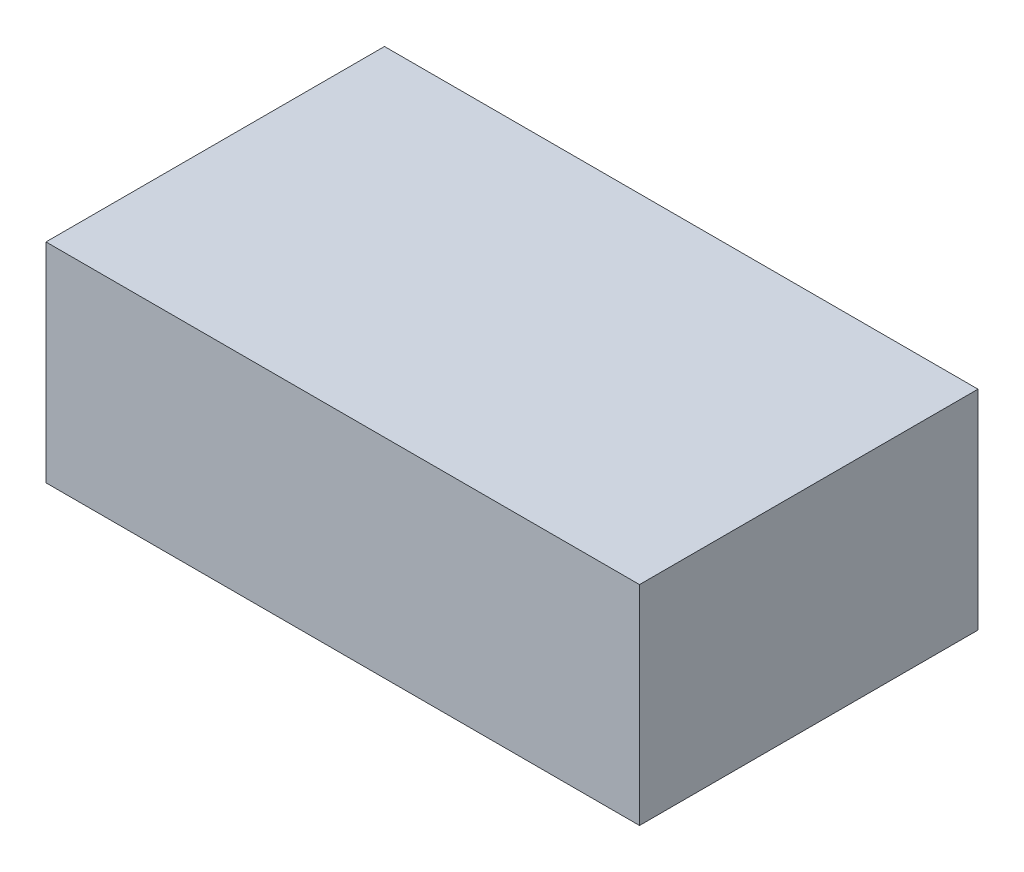
ISO-10303-21;
HEADER;
FILE_DESCRIPTION(('STEP AP214'),'2;1');
FILE_NAME('part.step','',(''),(''),'','','');
FILE_SCHEMA(('AUTOMOTIVE_DESIGN { 1 0 10303 214 1 1 1 1 }'));
ENDSEC;
DATA;
#1=APPLICATION_CONTEXT('core data for automotive mechanical design processes');
#2=APPLICATION_PROTOCOL_DEFINITION('international standard','automotive_design',2000,#1);
#3=PRODUCT_CONTEXT('',#1,'mechanical');
#4=PRODUCT('Part','Part','',(#3));
#5=PRODUCT_RELATED_PRODUCT_CATEGORY('part','',(#4));
#6=PRODUCT_DEFINITION_FORMATION('','',#4);
#7=PRODUCT_DEFINITION_CONTEXT('part definition',#1,'design');
#8=PRODUCT_DEFINITION('design','',#6,#7);
#9=PRODUCT_DEFINITION_SHAPE('','',#8);
#10=(LENGTH_UNIT() NAMED_UNIT(*) SI_UNIT(.MILLI.,.METRE.));
#11=(NAMED_UNIT(*) PLANE_ANGLE_UNIT() SI_UNIT($,.RADIAN.));
#12=(NAMED_UNIT(*) SI_UNIT($,.STERADIAN.) SOLID_ANGLE_UNIT());
#13=UNCERTAINTY_MEASURE_WITH_UNIT(LENGTH_MEASURE(1.E-05),#10,'distance_accuracy_value','');
#14=(GEOMETRIC_REPRESENTATION_CONTEXT(3) GLOBAL_UNCERTAINTY_ASSIGNED_CONTEXT((#13)) GLOBAL_UNIT_ASSIGNED_CONTEXT((#10,
#11,#12)) REPRESENTATION_CONTEXT('',''));
#15=CARTESIAN_POINT('',(0.,0.,0.));
#16=DIRECTION('',(0.,0.,1.));
#17=DIRECTION('',(1.,0.,0.));
#18=AXIS2_PLACEMENT_3D('',#15,#16,#17);
#19=CARTESIAN_POINT('',(0.,-4.,0.));
#20=DIRECTION('',(0.,-1.,0.));
#21=DIRECTION('',(0.,0.,-1.));
#22=AXIS2_PLACEMENT_3D('',#19,#20,#21);
#23=PLANE('',#22);
#24=DIRECTION('',(0.,0.,1.));
#25=VECTOR('',#24,1.);
#26=CARTESIAN_POINT('',(-18.5,-4.,21.3));
#27=LINE('',#26,#25);
#28=CARTESIAN_POINT('',(-18.5,-4.,21.3));
#29=VERTEX_POINT('',#28);
#30=CARTESIAN_POINT('',(-18.5,-4.,32.5));
#31=VERTEX_POINT('',#30);
#32=EDGE_CURVE('E236',#29,#31,#27,.T.);
#33=ORIENTED_EDGE('',*,*,#32,.T.);
#34=DIRECTION('',(-1.,0.,0.));
#35=VECTOR('',#34,1.);
#36=CARTESIAN_POINT('',(-60.,-4.,32.5));
#37=LINE('',#36,#35);
#38=CARTESIAN_POINT('',(-60.,-4.,32.5));
#39=VERTEX_POINT('',#38);
#40=EDGE_CURVE('E344',#31,#39,#37,.T.);
#41=ORIENTED_EDGE('',*,*,#40,.T.);
#42=DIRECTION('',(0.,0.,-1.));
#43=VECTOR('',#42,1.);
#44=CARTESIAN_POINT('',(-60.,-4.,-32.5));
#45=LINE('',#44,#43);
#46=CARTESIAN_POINT('',(-60.,-4.,-32.5));
#47=VERTEX_POINT('',#46);
#48=EDGE_CURVE('E294',#39,#47,#45,.T.);
#49=ORIENTED_EDGE('',*,*,#48,.T.);
#50=DIRECTION('',(1.,0.,0.));
#51=VECTOR('',#50,1.);
#52=CARTESIAN_POINT('',(60.,-4.,-32.5));
#53=LINE('',#52,#51);
#54=CARTESIAN_POINT('',(-18.5,-4.,-32.5));
#55=VERTEX_POINT('',#54);
#56=EDGE_CURVE('E339',#47,#55,#53,.T.);
#57=ORIENTED_EDGE('',*,*,#56,.T.);
#58=DIRECTION('',(0.,0.,1.));
#59=VECTOR('',#58,1.);
#60=CARTESIAN_POINT('',(-18.5,-4.,-32.5));
#61=LINE('',#60,#59);
#62=CARTESIAN_POINT('',(-18.5,-4.,-21.3));
#63=VERTEX_POINT('',#62);
#64=EDGE_CURVE('E276',#55,#63,#61,.T.);
#65=ORIENTED_EDGE('',*,*,#64,.T.);
#66=DIRECTION('',(1.,0.,0.));
#67=VECTOR('',#66,1.);
#68=CARTESIAN_POINT('',(-18.5,-4.,-21.3));
#69=LINE('',#68,#67);
#70=CARTESIAN_POINT('',(-15.,-4.,-21.3));
#71=VERTEX_POINT('',#70);
#72=EDGE_CURVE('E278',#63,#71,#69,.T.);
#73=ORIENTED_EDGE('',*,*,#72,.T.);
#74=DIRECTION('',(0.,0.,-1.));
#75=VECTOR('',#74,1.);
#76=CARTESIAN_POINT('',(-15.,-4.,-21.3));
#77=LINE('',#76,#75);
#78=CARTESIAN_POINT('',(-15.,-4.,-26.3));
#79=VERTEX_POINT('',#78);
#80=EDGE_CURVE('E280',#71,#79,#77,.T.);
#81=ORIENTED_EDGE('',*,*,#80,.T.);
#82=DIRECTION('',(1.,0.,0.));
#83=VECTOR('',#82,1.);
#84=CARTESIAN_POINT('',(-15.,-4.,-26.3));
#85=LINE('',#84,#83);
#86=CARTESIAN_POINT('',(-11.,-4.,-26.3));
#87=VERTEX_POINT('',#86);
#88=EDGE_CURVE('E282',#79,#87,#85,.T.);
#89=ORIENTED_EDGE('',*,*,#88,.T.);
#90=DIRECTION('',(0.,0.,1.));
#91=VECTOR('',#90,1.);
#92=CARTESIAN_POINT('',(-11.,-4.,-26.3));
#93=LINE('',#92,#91);
#94=CARTESIAN_POINT('',(-11.,-4.,26.3));
#95=VERTEX_POINT('',#94);
#96=EDGE_CURVE('E284',#87,#95,#93,.T.);
#97=ORIENTED_EDGE('',*,*,#96,.T.);
#98=DIRECTION('',(-1.,0.,0.));
#99=VECTOR('',#98,1.);
#100=CARTESIAN_POINT('',(-11.,-4.,26.3));
#101=LINE('',#100,#99);
#102=CARTESIAN_POINT('',(-15.,-4.,26.3));
#103=VERTEX_POINT('',#102);
#104=EDGE_CURVE('E286',#95,#103,#101,.T.);
#105=ORIENTED_EDGE('',*,*,#104,.T.);
#106=DIRECTION('',(0.,0.,-1.));
#107=VECTOR('',#106,1.);
#108=CARTESIAN_POINT('',(-15.,-4.,26.3));
#109=LINE('',#108,#107);
#110=CARTESIAN_POINT('',(-15.,-4.,21.3));
#111=VERTEX_POINT('',#110);
#112=EDGE_CURVE('E288',#103,#111,#109,.T.);
#113=ORIENTED_EDGE('',*,*,#112,.T.);
#114=DIRECTION('',(-1.,0.,0.));
#115=VECTOR('',#114,1.);
#116=CARTESIAN_POINT('',(-15.,-4.,21.3));
#117=LINE('',#116,#115);
#118=EDGE_CURVE('E241',#111,#29,#117,.T.);
#119=ORIENTED_EDGE('',*,*,#118,.T.);
#120=EDGE_LOOP('',(#33,#41,#49,#57,#65,#73,#81,#89,#97,#105,#113,#119));
#121=FACE_BOUND('',#120,.T.);
#122=ADVANCED_FACE('F33',(#121),#23,.T.);
#123=CARTESIAN_POINT('',(-64.,-4.,-36.5));
#124=DIRECTION('',(-1.,0.,0.));
#125=DIRECTION('',(0.,0.,1.));
#126=AXIS2_PLACEMENT_3D('',#123,#124,#125);
#127=PLANE('',#126);
#128=CARTESIAN_POINT('',(-64.,-25.,-12.));
#129=DIRECTION('',(-1.,0.,0.));
#130=DIRECTION('',(0.,0.,1.));
#131=AXIS2_PLACEMENT_3D('',#128,#129,#130);
#132=CIRCLE('',#131,4.);
#133=CARTESIAN_POINT('',(-64.,-21.,-12.));
#134=VERTEX_POINT('',#133);
#135=CARTESIAN_POINT('',(-64.,-29.,-12.));
#136=VERTEX_POINT('',#135);
#137=EDGE_CURVE('E50',#134,#136,#132,.T.);
#138=ORIENTED_EDGE('',*,*,#137,.F.);
#139=DIRECTION('',(0.,0.,1.));
#140=VECTOR('',#139,1.);
#141=CARTESIAN_POINT('',(-64.,-21.,-12.));
#142=LINE('',#141,#140);
#143=CARTESIAN_POINT('',(-64.,-21.,12.));
#144=VERTEX_POINT('',#143);
#145=EDGE_CURVE('E201',#134,#144,#142,.T.);
#146=ORIENTED_EDGE('',*,*,#145,.T.);
#147=CARTESIAN_POINT('',(-64.,-25.,12.));
#148=DIRECTION('',(-1.,0.,0.));
#149=DIRECTION('',(0.,0.,1.));
#150=AXIS2_PLACEMENT_3D('',#147,#148,#149);
#151=CIRCLE('',#150,4.);
#152=CARTESIAN_POINT('',(-64.,-29.,12.));
#153=VERTEX_POINT('',#152);
#154=EDGE_CURVE('E217',#153,#144,#151,.T.);
#155=ORIENTED_EDGE('',*,*,#154,.F.);
#156=DIRECTION('',(0.,0.,1.));
#157=VECTOR('',#156,1.);
#158=CARTESIAN_POINT('',(-64.,-29.,-12.));
#159=LINE('',#158,#157);
#160=EDGE_CURVE('E215',#136,#153,#159,.T.);
#161=ORIENTED_EDGE('',*,*,#160,.F.);
#162=EDGE_LOOP('',(#138,#146,#155,#161));
#163=FACE_BOUND('',#162,.T.);
#164=DIRECTION('',(0.,0.,1.));
#165=VECTOR('',#164,1.);
#166=CARTESIAN_POINT('',(-64.,0.,-36.5));
#167=LINE('',#166,#165);
#168=CARTESIAN_POINT('',(-64.,0.,-36.5));
#169=VERTEX_POINT('',#168);
#170=CARTESIAN_POINT('',(-64.,0.,36.5));
#171=VERTEX_POINT('',#170);
#172=EDGE_CURVE('E369',#169,#171,#167,.T.);
#173=ORIENTED_EDGE('',*,*,#172,.F.);
#174=DIRECTION('',(0.,1.,0.));
#175=VECTOR('',#174,1.);
#176=CARTESIAN_POINT('',(-64.,-4.,-36.5));
#177=LINE('',#176,#175);
#178=CARTESIAN_POINT('',(-64.,-45.,-36.5));
#179=VERTEX_POINT('',#178);
#180=EDGE_CURVE('E11',#179,#169,#177,.T.);
#181=ORIENTED_EDGE('',*,*,#180,.F.);
#182=DIRECTION('',(0.,0.,-1.));
#183=VECTOR('',#182,1.);
#184=CARTESIAN_POINT('',(-64.,-45.,-36.5));
#185=LINE('',#184,#183);
#186=CARTESIAN_POINT('',(-64.,-45.,36.5));
#187=VERTEX_POINT('',#186);
#188=EDGE_CURVE('E360',#187,#179,#185,.T.);
#189=ORIENTED_EDGE('',*,*,#188,.F.);
#190=DIRECTION('',(0.,1.,0.));
#191=VECTOR('',#190,1.);
#192=CARTESIAN_POINT('',(-64.,-4.,36.5));
#193=LINE('',#192,#191);
#194=EDGE_CURVE('E37',#187,#171,#193,.T.);
#195=ORIENTED_EDGE('',*,*,#194,.T.);
#196=EDGE_LOOP('',(#173,#181,#189,#195));
#197=FACE_BOUND('',#196,.T.);
#198=ADVANCED_FACE('F35',(#163,#197),#127,.T.);
#199=CARTESIAN_POINT('',(64.,-4.,-36.5));
#200=DIRECTION('',(0.,0.,-1.));
#201=DIRECTION('',(-1.,0.,0.));
#202=AXIS2_PLACEMENT_3D('',#199,#200,#201);
#203=PLANE('',#202);
#204=CARTESIAN_POINT('',(-44.,-25.,-36.5));
#205=DIRECTION('',(0.,0.,-1.));
#206=DIRECTION('',(-1.,0.,0.));
#207=AXIS2_PLACEMENT_3D('',#204,#205,#206);
#208=CIRCLE('',#207,10.16);
#209=CARTESIAN_POINT('',(-54.16,-25.,-36.5));
#210=VERTEX_POINT('',#209);
#211=EDGE_CURVE('E233',#210,#210,#208,.T.);
#212=ORIENTED_EDGE('',*,*,#211,.F.);
#213=EDGE_LOOP('',(#212));
#214=FACE_BOUND('',#213,.T.);
#215=DIRECTION('',(-1.,0.,0.));
#216=VECTOR('',#215,1.);
#217=CARTESIAN_POINT('',(64.,0.,-36.5));
#218=LINE('',#217,#216);
#219=CARTESIAN_POINT('',(64.,0.,-36.5));
#220=VERTEX_POINT('',#219);
#221=EDGE_CURVE('E378',#220,#169,#218,.T.);
#222=ORIENTED_EDGE('',*,*,#221,.F.);
#223=DIRECTION('',(0.,1.,0.));
#224=VECTOR('',#223,1.);
#225=CARTESIAN_POINT('',(64.,-4.,-36.5));
#226=LINE('',#225,#224);
#227=CARTESIAN_POINT('',(64.,-45.,-36.5));
#228=VERTEX_POINT('',#227);
#229=EDGE_CURVE('E42',#228,#220,#226,.T.);
#230=ORIENTED_EDGE('',*,*,#229,.F.);
#231=DIRECTION('',(1.,0.,0.));
#232=VECTOR('',#231,1.);
#233=CARTESIAN_POINT('',(64.,-45.,-36.5));
#234=LINE('',#233,#232);
#235=EDGE_CURVE('E363',#179,#228,#234,.T.);
#236=ORIENTED_EDGE('',*,*,#235,.F.);
#237=ORIENTED_EDGE('',*,*,#180,.T.);
#238=EDGE_LOOP('',(#222,#230,#236,#237));
#239=FACE_BOUND('',#238,.T.);
#240=ADVANCED_FACE('F393',(#214,#239),#203,.T.);
#241=CARTESIAN_POINT('',(64.,-4.,-36.5));
#242=DIRECTION('',(1.,0.,0.));
#243=DIRECTION('',(0.,0.,-1.));
#244=AXIS2_PLACEMENT_3D('',#241,#242,#243);
#245=PLANE('',#244);
#246=DIRECTION('',(0.,0.,-1.));
#247=VECTOR('',#246,1.);
#248=CARTESIAN_POINT('',(64.,0.,-36.5));
#249=LINE('',#248,#247);
#250=CARTESIAN_POINT('',(64.,0.,36.5));
#251=VERTEX_POINT('',#250);
#252=EDGE_CURVE('E375',#251,#220,#249,.T.);
#253=ORIENTED_EDGE('',*,*,#252,.F.);
#254=DIRECTION('',(0.,1.,0.));
#255=VECTOR('',#254,1.);
#256=CARTESIAN_POINT('',(64.,-4.,36.5));
#257=LINE('',#256,#255);
#258=CARTESIAN_POINT('',(64.,-45.,36.5));
#259=VERTEX_POINT('',#258);
#260=EDGE_CURVE('E381',#259,#251,#257,.T.);
#261=ORIENTED_EDGE('',*,*,#260,.F.);
#262=DIRECTION('',(0.,0.,1.));
#263=VECTOR('',#262,1.);
#264=CARTESIAN_POINT('',(64.,-45.,36.5));
#265=LINE('',#264,#263);
#266=EDGE_CURVE('E366',#228,#259,#265,.T.);
#267=ORIENTED_EDGE('',*,*,#266,.F.);
#268=ORIENTED_EDGE('',*,*,#229,.T.);
#269=EDGE_LOOP('',(#253,#261,#267,#268));
#270=FACE_BOUND('',#269,.T.);
#271=ADVANCED_FACE('F400',(#270),#245,.T.);
#272=CARTESIAN_POINT('',(64.,-4.,36.5));
#273=DIRECTION('',(0.,0.,1.));
#274=DIRECTION('',(1.,0.,0.));
#275=AXIS2_PLACEMENT_3D('',#272,#273,#274);
#276=PLANE('',#275);
#277=DIRECTION('',(1.,0.,0.));
#278=VECTOR('',#277,1.);
#279=CARTESIAN_POINT('',(64.,0.,36.5));
#280=LINE('',#279,#278);
#281=EDGE_CURVE('E372',#171,#251,#280,.T.);
#282=ORIENTED_EDGE('',*,*,#281,.F.);
#283=ORIENTED_EDGE('',*,*,#194,.F.);
#284=DIRECTION('',(-1.,0.,0.));
#285=VECTOR('',#284,1.);
#286=CARTESIAN_POINT('',(-64.,-45.,36.5));
#287=LINE('',#286,#285);
#288=EDGE_CURVE('E357',#259,#187,#287,.T.);
#289=ORIENTED_EDGE('',*,*,#288,.F.);
#290=ORIENTED_EDGE('',*,*,#260,.T.);
#291=EDGE_LOOP('',(#282,#283,#289,#290));
#292=FACE_BOUND('',#291,.T.);
#293=ADVANCED_FACE('F388',(#292),#276,.T.);
#294=CARTESIAN_POINT('',(0.,0.,0.));
#295=DIRECTION('',(0.,-1.,0.));
#296=DIRECTION('',(0.,0.,-1.));
#297=AXIS2_PLACEMENT_3D('',#294,#295,#296);
#298=PLANE('',#297);
#299=ORIENTED_EDGE('',*,*,#172,.T.);
#300=ORIENTED_EDGE('',*,*,#281,.T.);
#301=ORIENTED_EDGE('',*,*,#252,.T.);
#302=ORIENTED_EDGE('',*,*,#221,.T.);
#303=EDGE_LOOP('',(#299,#300,#301,#302));
#304=FACE_BOUND('',#303,.T.);
#305=ADVANCED_FACE('F390',(#304),#298,.F.);
#306=CARTESIAN_POINT('',(0.,-45.,0.));
#307=DIRECTION('',(0.,1.,0.));
#308=DIRECTION('',(0.,0.,1.));
#309=AXIS2_PLACEMENT_3D('',#306,#307,#308);
#310=PLANE('',#309);
#311=ORIENTED_EDGE('',*,*,#288,.T.);
#312=ORIENTED_EDGE('',*,*,#188,.T.);
#313=ORIENTED_EDGE('',*,*,#235,.T.);
#314=ORIENTED_EDGE('',*,*,#266,.T.);
#315=EDGE_LOOP('',(#311,#312,#313,#314));
#316=FACE_BOUND('',#315,.T.);
#317=DIRECTION('',(0.,0.,-1.));
#318=VECTOR('',#317,1.);
#319=CARTESIAN_POINT('',(-60.,-45.,-32.5));
#320=LINE('',#319,#318);
#321=CARTESIAN_POINT('',(-60.,-45.,32.5));
#322=VERTEX_POINT('',#321);
#323=CARTESIAN_POINT('',(-60.,-45.,-32.5));
#324=VERTEX_POINT('',#323);
#325=EDGE_CURVE('E326',#322,#324,#320,.T.);
#326=ORIENTED_EDGE('',*,*,#325,.F.);
#327=DIRECTION('',(-1.,0.,0.));
#328=VECTOR('',#327,1.);
#329=CARTESIAN_POINT('',(-60.,-45.,32.5));
#330=LINE('',#329,#328);
#331=CARTESIAN_POINT('',(60.,-45.,32.5));
#332=VERTEX_POINT('',#331);
#333=EDGE_CURVE('E334',#332,#322,#330,.T.);
#334=ORIENTED_EDGE('',*,*,#333,.F.);
#335=DIRECTION('',(0.,0.,1.));
#336=VECTOR('',#335,1.);
#337=CARTESIAN_POINT('',(60.,-45.,32.5));
#338=LINE('',#337,#336);
#339=CARTESIAN_POINT('',(60.,-45.,-32.5));
#340=VERTEX_POINT('',#339);
#341=EDGE_CURVE('E331',#340,#332,#338,.T.);
#342=ORIENTED_EDGE('',*,*,#341,.F.);
#343=DIRECTION('',(1.,0.,0.));
#344=VECTOR('',#343,1.);
#345=CARTESIAN_POINT('',(60.,-45.,-32.5));
#346=LINE('',#345,#344);
#347=EDGE_CURVE('E328',#324,#340,#346,.T.);
#348=ORIENTED_EDGE('',*,*,#347,.F.);
#349=EDGE_LOOP('',(#326,#334,#342,#348));
#350=FACE_BOUND('',#349,.T.);
#351=ADVANCED_FACE('F396',(#316,#350),#310,.F.);
#352=CARTESIAN_POINT('',(-60.,-45.,-32.5));
#353=DIRECTION('',(1.,0.,0.));
#354=DIRECTION('',(0.,0.,-1.));
#355=AXIS2_PLACEMENT_3D('',#352,#353,#354);
#356=PLANE('',#355);
#357=CARTESIAN_POINT('',(-60.,-25.,-12.));
#358=DIRECTION('',(1.,0.,0.));
#359=DIRECTION('',(0.,0.,-1.));
#360=AXIS2_PLACEMENT_3D('',#357,#358,#359);
#361=CIRCLE('',#360,4.);
#362=CARTESIAN_POINT('',(-60.,-21.,-12.));
#363=VERTEX_POINT('',#362);
#364=CARTESIAN_POINT('',(-60.,-29.,-12.));
#365=VERTEX_POINT('',#364);
#366=EDGE_CURVE('E198',#363,#365,#361,.F.);
#367=ORIENTED_EDGE('',*,*,#366,.T.);
#368=DIRECTION('',(0.,0.,1.));
#369=VECTOR('',#368,1.);
#370=CARTESIAN_POINT('',(-60.,-29.,-12.));
#371=LINE('',#370,#369);
#372=CARTESIAN_POINT('',(-60.,-29.,12.));
#373=VERTEX_POINT('',#372);
#374=EDGE_CURVE('E219',#365,#373,#371,.T.);
#375=ORIENTED_EDGE('',*,*,#374,.T.);
#376=CARTESIAN_POINT('',(-60.,-25.,12.));
#377=DIRECTION('',(1.,0.,0.));
#378=DIRECTION('',(0.,0.,-1.));
#379=AXIS2_PLACEMENT_3D('',#376,#377,#378);
#380=CIRCLE('',#379,4.);
#381=CARTESIAN_POINT('',(-60.,-21.,12.));
#382=VERTEX_POINT('',#381);
#383=EDGE_CURVE('E211',#373,#382,#380,.F.);
#384=ORIENTED_EDGE('',*,*,#383,.T.);
#385=DIRECTION('',(0.,0.,1.));
#386=VECTOR('',#385,1.);
#387=CARTESIAN_POINT('',(-60.,-21.,-12.));
#388=LINE('',#387,#386);
#389=EDGE_CURVE('E224',#363,#382,#388,.T.);
#390=ORIENTED_EDGE('',*,*,#389,.F.);
#391=EDGE_LOOP('',(#367,#375,#384,#390));
#392=FACE_BOUND('',#391,.T.);
#393=ORIENTED_EDGE('',*,*,#48,.F.);
#394=DIRECTION('',(0.,1.,0.));
#395=VECTOR('',#394,1.);
#396=CARTESIAN_POINT('',(-60.,-45.,32.5));
#397=LINE('',#396,#395);
#398=EDGE_CURVE('E336',#322,#39,#397,.T.);
#399=ORIENTED_EDGE('',*,*,#398,.F.);
#400=ORIENTED_EDGE('',*,*,#325,.T.);
#401=DIRECTION('',(0.,1.,0.));
#402=VECTOR('',#401,1.);
#403=CARTESIAN_POINT('',(-60.,-45.,-32.5));
#404=LINE('',#403,#402);
#405=EDGE_CURVE('E354',#324,#47,#404,.T.);
#406=ORIENTED_EDGE('',*,*,#405,.T.);
#407=EDGE_LOOP('',(#393,#399,#400,#406));
#408=FACE_BOUND('',#407,.T.);
#409=ADVANCED_FACE('F460',(#392,#408),#356,.T.);
#410=CARTESIAN_POINT('',(60.,-45.,-32.5));
#411=DIRECTION('',(0.,0.,1.));
#412=DIRECTION('',(1.,0.,0.));
#413=AXIS2_PLACEMENT_3D('',#410,#411,#412);
#414=PLANE('',#413);
#415=CARTESIAN_POINT('',(-44.,-25.,-32.5));
#416=DIRECTION('',(0.,0.,1.));
#417=DIRECTION('',(1.,0.,0.));
#418=AXIS2_PLACEMENT_3D('',#415,#416,#417);
#419=CIRCLE('',#418,10.16);
#420=CARTESIAN_POINT('',(-33.84,-25.,-32.5));
#421=VERTEX_POINT('',#420);
#422=EDGE_CURVE('E226',#421,#421,#419,.F.);
#423=ORIENTED_EDGE('',*,*,#422,.T.);
#424=EDGE_LOOP('',(#423));
#425=FACE_BOUND('',#424,.T.);
#426=DIRECTION('',(0.,1.,0.));
#427=VECTOR('',#426,1.);
#428=CARTESIAN_POINT('',(-18.5,-38.,-32.5));
#429=LINE('',#428,#427);
#430=CARTESIAN_POINT('',(-18.5,-38.,-32.5));
#431=VERTEX_POINT('',#430);
#432=EDGE_CURVE('E316',#431,#55,#429,.T.);
#433=ORIENTED_EDGE('',*,*,#432,.T.);
#434=ORIENTED_EDGE('',*,*,#56,.F.);
#435=ORIENTED_EDGE('',*,*,#405,.F.);
#436=ORIENTED_EDGE('',*,*,#347,.T.);
#437=DIRECTION('',(0.,1.,0.));
#438=VECTOR('',#437,1.);
#439=CARTESIAN_POINT('',(60.,-45.,-32.5));
#440=LINE('',#439,#438);
#441=CARTESIAN_POINT('',(60.,-4.,-32.5));
#442=VERTEX_POINT('',#441);
#443=EDGE_CURVE('E351',#340,#442,#440,.T.);
#444=ORIENTED_EDGE('',*,*,#443,.T.);
#445=CARTESIAN_POINT('',(-4.99999999999998,-4.,-32.5));
#446=VERTEX_POINT('',#445);
#447=EDGE_CURVE('E338',#446,#442,#53,.T.);
#448=ORIENTED_EDGE('',*,*,#447,.F.);
#449=DIRECTION('',(0.,1.,0.));
#450=VECTOR('',#449,1.);
#451=CARTESIAN_POINT('',(-4.99999999999997,-38.,-32.5));
#452=LINE('',#451,#450);
#453=CARTESIAN_POINT('',(-4.99999999999998,-38.,-32.5));
#454=VERTEX_POINT('',#453);
#455=EDGE_CURVE('E318',#454,#446,#452,.T.);
#456=ORIENTED_EDGE('',*,*,#455,.F.);
#457=DIRECTION('',(-1.,0.,0.));
#458=VECTOR('',#457,1.);
#459=CARTESIAN_POINT('',(-4.99999999999997,-38.,-32.5));
#460=LINE('',#459,#458);
#461=EDGE_CURVE('E246',#454,#431,#460,.T.);
#462=ORIENTED_EDGE('',*,*,#461,.T.);
#463=EDGE_LOOP('',(#433,#434,#435,#436,#444,#448,#456,#462));
#464=FACE_BOUND('',#463,.T.);
#465=ADVANCED_FACE('F438',(#425,#464),#414,.T.);
#466=CARTESIAN_POINT('',(60.,-45.,32.5));
#467=DIRECTION('',(-1.,0.,0.));
#468=DIRECTION('',(0.,0.,1.));
#469=AXIS2_PLACEMENT_3D('',#466,#467,#468);
#470=PLANE('',#469);
#471=DIRECTION('',(0.,0.,1.));
#472=VECTOR('',#471,1.);
#473=CARTESIAN_POINT('',(60.,-4.,32.5));
#474=LINE('',#473,#472);
#475=CARTESIAN_POINT('',(60.,-4.,32.5));
#476=VERTEX_POINT('',#475);
#477=EDGE_CURVE('E342',#442,#476,#474,.T.);
#478=ORIENTED_EDGE('',*,*,#477,.F.);
#479=ORIENTED_EDGE('',*,*,#443,.F.);
#480=ORIENTED_EDGE('',*,*,#341,.T.);
#481=DIRECTION('',(0.,1.,0.));
#482=VECTOR('',#481,1.);
#483=CARTESIAN_POINT('',(60.,-45.,32.5));
#484=LINE('',#483,#482);
#485=EDGE_CURVE('E348',#332,#476,#484,.T.);
#486=ORIENTED_EDGE('',*,*,#485,.T.);
#487=EDGE_LOOP('',(#478,#479,#480,#486));
#488=FACE_BOUND('',#487,.T.);
#489=ADVANCED_FACE('F429',(#488),#470,.T.);
#490=CARTESIAN_POINT('',(-60.,-45.,32.5));
#491=DIRECTION('',(0.,0.,-1.));
#492=DIRECTION('',(-1.,0.,0.));
#493=AXIS2_PLACEMENT_3D('',#490,#491,#492);
#494=PLANE('',#493);
#495=DIRECTION('',(0.,1.,0.));
#496=VECTOR('',#495,1.);
#497=CARTESIAN_POINT('',(-18.5,-38.,32.5));
#498=LINE('',#497,#496);
#499=CARTESIAN_POINT('',(-18.5,-38.,32.5));
#500=VERTEX_POINT('',#499);
#501=EDGE_CURVE('E272',#500,#31,#498,.T.);
#502=ORIENTED_EDGE('',*,*,#501,.F.);
#503=DIRECTION('',(1.,0.,0.));
#504=VECTOR('',#503,1.);
#505=CARTESIAN_POINT('',(-18.5,-38.,32.5));
#506=LINE('',#505,#504);
#507=CARTESIAN_POINT('',(-4.99999999999997,-38.,32.5));
#508=VERTEX_POINT('',#507);
#509=EDGE_CURVE('E240',#500,#508,#506,.T.);
#510=ORIENTED_EDGE('',*,*,#509,.T.);
#511=DIRECTION('',(0.,1.,0.));
#512=VECTOR('',#511,1.);
#513=CARTESIAN_POINT('',(-4.99999999999998,-38.,32.5));
#514=LINE('',#513,#512);
#515=CARTESIAN_POINT('',(-4.99999999999998,-4.,32.5));
#516=VERTEX_POINT('',#515);
#517=EDGE_CURVE('E321',#508,#516,#514,.T.);
#518=ORIENTED_EDGE('',*,*,#517,.T.);
#519=EDGE_CURVE('E329',#476,#516,#37,.T.);
#520=ORIENTED_EDGE('',*,*,#519,.F.);
#521=ORIENTED_EDGE('',*,*,#485,.F.);
#522=ORIENTED_EDGE('',*,*,#333,.T.);
#523=ORIENTED_EDGE('',*,*,#398,.T.);
#524=ORIENTED_EDGE('',*,*,#40,.F.);
#525=EDGE_LOOP('',(#502,#510,#518,#520,#521,#522,#523,#524));
#526=FACE_BOUND('',#525,.T.);
#527=ADVANCED_FACE('F420',(#526),#494,.T.);
#528=DIRECTION('',(0.,0.,-1.));
#529=VECTOR('',#528,1.);
#530=CARTESIAN_POINT('',(-4.99999999999998,-4.,32.5));
#531=LINE('',#530,#529);
#532=EDGE_CURVE('E274',#516,#446,#531,.T.);
#533=ORIENTED_EDGE('',*,*,#532,.T.);
#534=ORIENTED_EDGE('',*,*,#447,.T.);
#535=ORIENTED_EDGE('',*,*,#477,.T.);
#536=ORIENTED_EDGE('',*,*,#519,.T.);
#537=EDGE_LOOP('',(#533,#534,#535,#536));
#538=FACE_BOUND('',#537,.T.);
#539=ADVANCED_FACE('F412',(#538),#23,.T.);
#540=CARTESIAN_POINT('',(-18.5,-38.,21.3));
#541=DIRECTION('',(-1.,0.,0.));
#542=DIRECTION('',(0.,0.,1.));
#543=AXIS2_PLACEMENT_3D('',#540,#541,#542);
#544=PLANE('',#543);
#545=ORIENTED_EDGE('',*,*,#32,.F.);
#546=DIRECTION('',(0.,1.,0.));
#547=VECTOR('',#546,1.);
#548=CARTESIAN_POINT('',(-18.5,-38.,21.3));
#549=LINE('',#548,#547);
#550=CARTESIAN_POINT('',(-18.5,-38.,21.3));
#551=VERTEX_POINT('',#550);
#552=EDGE_CURVE('E291',#551,#29,#549,.T.);
#553=ORIENTED_EDGE('',*,*,#552,.F.);
#554=DIRECTION('',(0.,0.,1.));
#555=VECTOR('',#554,1.);
#556=CARTESIAN_POINT('',(-18.5,-38.,21.3));
#557=LINE('',#556,#555);
#558=EDGE_CURVE('E237',#551,#500,#557,.T.);
#559=ORIENTED_EDGE('',*,*,#558,.T.);
#560=ORIENTED_EDGE('',*,*,#501,.T.);
#561=EDGE_LOOP('',(#545,#553,#559,#560));
#562=FACE_BOUND('',#561,.T.);
#563=ADVANCED_FACE('F419',(#562),#544,.T.);
#564=CARTESIAN_POINT('',(-15.,-38.,21.3));
#565=DIRECTION('',(0.,0.,-1.));
#566=DIRECTION('',(-1.,0.,0.));
#567=AXIS2_PLACEMENT_3D('',#564,#565,#566);
#568=PLANE('',#567);
#569=ORIENTED_EDGE('',*,*,#118,.F.);
#570=DIRECTION('',(0.,1.,0.));
#571=VECTOR('',#570,1.);
#572=CARTESIAN_POINT('',(-15.,-38.,21.3));
#573=LINE('',#572,#571);
#574=CARTESIAN_POINT('',(-15.,-38.,21.3));
#575=VERTEX_POINT('',#574);
#576=EDGE_CURVE('E295',#575,#111,#573,.T.);
#577=ORIENTED_EDGE('',*,*,#576,.F.);
#578=DIRECTION('',(-1.,0.,0.));
#579=VECTOR('',#578,1.);
#580=CARTESIAN_POINT('',(-15.,-38.,21.3));
#581=LINE('',#580,#579);
#582=EDGE_CURVE('E269',#575,#551,#581,.T.);
#583=ORIENTED_EDGE('',*,*,#582,.T.);
#584=ORIENTED_EDGE('',*,*,#552,.T.);
#585=EDGE_LOOP('',(#569,#577,#583,#584));
#586=FACE_BOUND('',#585,.T.);
#587=ADVANCED_FACE('F426',(#586),#568,.T.);
#588=CARTESIAN_POINT('',(-15.,-38.,26.3));
#589=DIRECTION('',(1.,0.,0.));
#590=DIRECTION('',(0.,0.,-1.));
#591=AXIS2_PLACEMENT_3D('',#588,#589,#590);
#592=PLANE('',#591);
#593=ORIENTED_EDGE('',*,*,#112,.F.);
#594=DIRECTION('',(0.,1.,0.));
#595=VECTOR('',#594,1.);
#596=CARTESIAN_POINT('',(-15.,-38.,26.3));
#597=LINE('',#596,#595);
#598=CARTESIAN_POINT('',(-15.,-38.,26.3));
#599=VERTEX_POINT('',#598);
#600=EDGE_CURVE('E298',#599,#103,#597,.T.);
#601=ORIENTED_EDGE('',*,*,#600,.F.);
#602=DIRECTION('',(0.,0.,-1.));
#603=VECTOR('',#602,1.);
#604=CARTESIAN_POINT('',(-15.,-38.,26.3));
#605=LINE('',#604,#603);
#606=EDGE_CURVE('E266',#599,#575,#605,.T.);
#607=ORIENTED_EDGE('',*,*,#606,.T.);
#608=ORIENTED_EDGE('',*,*,#576,.T.);
#609=EDGE_LOOP('',(#593,#601,#607,#608));
#610=FACE_BOUND('',#609,.T.);
#611=ADVANCED_FACE('F474',(#610),#592,.T.);
#612=CARTESIAN_POINT('',(-11.,-38.,26.3));
#613=DIRECTION('',(0.,0.,-1.));
#614=DIRECTION('',(-1.,0.,0.));
#615=AXIS2_PLACEMENT_3D('',#612,#613,#614);
#616=PLANE('',#615);
#617=ORIENTED_EDGE('',*,*,#104,.F.);
#618=DIRECTION('',(0.,1.,0.));
#619=VECTOR('',#618,1.);
#620=CARTESIAN_POINT('',(-11.,-38.,26.3));
#621=LINE('',#620,#619);
#622=CARTESIAN_POINT('',(-11.,-38.,26.3));
#623=VERTEX_POINT('',#622);
#624=EDGE_CURVE('E301',#623,#95,#621,.T.);
#625=ORIENTED_EDGE('',*,*,#624,.F.);
#626=DIRECTION('',(-1.,0.,0.));
#627=VECTOR('',#626,1.);
#628=CARTESIAN_POINT('',(-11.,-38.,26.3));
#629=LINE('',#628,#627);
#630=EDGE_CURVE('E263',#623,#599,#629,.T.);
#631=ORIENTED_EDGE('',*,*,#630,.T.);
#632=ORIENTED_EDGE('',*,*,#600,.T.);
#633=EDGE_LOOP('',(#617,#625,#631,#632));
#634=FACE_BOUND('',#633,.T.);
#635=ADVANCED_FACE('F479',(#634),#616,.T.);
#636=CARTESIAN_POINT('',(-11.,-38.,-26.3));
#637=DIRECTION('',(-1.,0.,0.));
#638=DIRECTION('',(0.,0.,1.));
#639=AXIS2_PLACEMENT_3D('',#636,#637,#638);
#640=PLANE('',#639);
#641=ORIENTED_EDGE('',*,*,#96,.F.);
#642=DIRECTION('',(0.,1.,0.));
#643=VECTOR('',#642,1.);
#644=CARTESIAN_POINT('',(-11.,-38.,-26.3));
#645=LINE('',#644,#643);
#646=CARTESIAN_POINT('',(-11.,-38.,-26.3));
#647=VERTEX_POINT('',#646);
#648=EDGE_CURVE('E304',#647,#87,#645,.T.);
#649=ORIENTED_EDGE('',*,*,#648,.F.);
#650=DIRECTION('',(0.,0.,1.));
#651=VECTOR('',#650,1.);
#652=CARTESIAN_POINT('',(-11.,-38.,-26.3));
#653=LINE('',#652,#651);
#654=EDGE_CURVE('E260',#647,#623,#653,.T.);
#655=ORIENTED_EDGE('',*,*,#654,.T.);
#656=ORIENTED_EDGE('',*,*,#624,.T.);
#657=EDGE_LOOP('',(#641,#649,#655,#656));
#658=FACE_BOUND('',#657,.T.);
#659=ADVANCED_FACE('F482',(#658),#640,.T.);
#660=CARTESIAN_POINT('',(-15.,-38.,-26.3));
#661=DIRECTION('',(0.,0.,1.));
#662=DIRECTION('',(1.,0.,0.));
#663=AXIS2_PLACEMENT_3D('',#660,#661,#662);
#664=PLANE('',#663);
#665=ORIENTED_EDGE('',*,*,#88,.F.);
#666=DIRECTION('',(0.,1.,0.));
#667=VECTOR('',#666,1.);
#668=CARTESIAN_POINT('',(-15.,-38.,-26.3));
#669=LINE('',#668,#667);
#670=CARTESIAN_POINT('',(-15.,-38.,-26.3));
#671=VERTEX_POINT('',#670);
#672=EDGE_CURVE('E307',#671,#79,#669,.T.);
#673=ORIENTED_EDGE('',*,*,#672,.F.);
#674=DIRECTION('',(1.,0.,0.));
#675=VECTOR('',#674,1.);
#676=CARTESIAN_POINT('',(-15.,-38.,-26.3));
#677=LINE('',#676,#675);
#678=EDGE_CURVE('E257',#671,#647,#677,.T.);
#679=ORIENTED_EDGE('',*,*,#678,.T.);
#680=ORIENTED_EDGE('',*,*,#648,.T.);
#681=EDGE_LOOP('',(#665,#673,#679,#680));
#682=FACE_BOUND('',#681,.T.);
#683=ADVANCED_FACE('F487',(#682),#664,.T.);
#684=CARTESIAN_POINT('',(-15.,-38.,-21.3));
#685=DIRECTION('',(1.,0.,0.));
#686=DIRECTION('',(0.,0.,-1.));
#687=AXIS2_PLACEMENT_3D('',#684,#685,#686);
#688=PLANE('',#687);
#689=ORIENTED_EDGE('',*,*,#80,.F.);
#690=DIRECTION('',(0.,1.,0.));
#691=VECTOR('',#690,1.);
#692=CARTESIAN_POINT('',(-15.,-38.,-21.3));
#693=LINE('',#692,#691);
#694=CARTESIAN_POINT('',(-15.,-38.,-21.3));
#695=VERTEX_POINT('',#694);
#696=EDGE_CURVE('E310',#695,#71,#693,.T.);
#697=ORIENTED_EDGE('',*,*,#696,.F.);
#698=DIRECTION('',(0.,0.,-1.));
#699=VECTOR('',#698,1.);
#700=CARTESIAN_POINT('',(-15.,-38.,-21.3));
#701=LINE('',#700,#699);
#702=EDGE_CURVE('E254',#695,#671,#701,.T.);
#703=ORIENTED_EDGE('',*,*,#702,.T.);
#704=ORIENTED_EDGE('',*,*,#672,.T.);
#705=EDGE_LOOP('',(#689,#697,#703,#704));
#706=FACE_BOUND('',#705,.T.);
#707=ADVANCED_FACE('F490',(#706),#688,.T.);
#708=CARTESIAN_POINT('',(-18.5,-38.,-21.3));
#709=DIRECTION('',(0.,0.,1.));
#710=DIRECTION('',(1.,0.,0.));
#711=AXIS2_PLACEMENT_3D('',#708,#709,#710);
#712=PLANE('',#711);
#713=ORIENTED_EDGE('',*,*,#72,.F.);
#714=DIRECTION('',(0.,1.,0.));
#715=VECTOR('',#714,1.);
#716=CARTESIAN_POINT('',(-18.5,-38.,-21.3));
#717=LINE('',#716,#715);
#718=CARTESIAN_POINT('',(-18.5,-38.,-21.3));
#719=VERTEX_POINT('',#718);
#720=EDGE_CURVE('E313',#719,#63,#717,.T.);
#721=ORIENTED_EDGE('',*,*,#720,.F.);
#722=DIRECTION('',(1.,0.,0.));
#723=VECTOR('',#722,1.);
#724=CARTESIAN_POINT('',(-18.5,-38.,-21.3));
#725=LINE('',#724,#723);
#726=EDGE_CURVE('E251',#719,#695,#725,.T.);
#727=ORIENTED_EDGE('',*,*,#726,.T.);
#728=ORIENTED_EDGE('',*,*,#696,.T.);
#729=EDGE_LOOP('',(#713,#721,#727,#728));
#730=FACE_BOUND('',#729,.T.);
#731=ADVANCED_FACE('F492',(#730),#712,.T.);
#732=CARTESIAN_POINT('',(-18.5,-38.,-32.5));
#733=DIRECTION('',(-1.,0.,0.));
#734=DIRECTION('',(0.,0.,1.));
#735=AXIS2_PLACEMENT_3D('',#732,#733,#734);
#736=PLANE('',#735);
#737=ORIENTED_EDGE('',*,*,#64,.F.);
#738=ORIENTED_EDGE('',*,*,#432,.F.);
#739=DIRECTION('',(0.,0.,1.));
#740=VECTOR('',#739,1.);
#741=CARTESIAN_POINT('',(-18.5,-38.,-32.5));
#742=LINE('',#741,#740);
#743=EDGE_CURVE('E248',#431,#719,#742,.T.);
#744=ORIENTED_EDGE('',*,*,#743,.T.);
#745=ORIENTED_EDGE('',*,*,#720,.T.);
#746=EDGE_LOOP('',(#737,#738,#744,#745));
#747=FACE_BOUND('',#746,.T.);
#748=ADVANCED_FACE('F454',(#747),#736,.T.);
#749=CARTESIAN_POINT('',(-4.99999999999998,-38.,32.5));
#750=DIRECTION('',(1.,0.,0.));
#751=DIRECTION('',(0.,0.,-1.));
#752=AXIS2_PLACEMENT_3D('',#749,#750,#751);
#753=PLANE('',#752);
#754=ORIENTED_EDGE('',*,*,#532,.F.);
#755=ORIENTED_EDGE('',*,*,#517,.F.);
#756=DIRECTION('',(0.,0.,-1.));
#757=VECTOR('',#756,1.);
#758=CARTESIAN_POINT('',(-4.99999999999998,-38.,32.5));
#759=LINE('',#758,#757);
#760=EDGE_CURVE('E243',#508,#454,#759,.T.);
#761=ORIENTED_EDGE('',*,*,#760,.T.);
#762=ORIENTED_EDGE('',*,*,#455,.T.);
#763=EDGE_LOOP('',(#754,#755,#761,#762));
#764=FACE_BOUND('',#763,.T.);
#765=ADVANCED_FACE('F442',(#764),#753,.T.);
#766=CARTESIAN_POINT('',(0.,-38.,0.));
#767=DIRECTION('',(0.,1.,0.));
#768=DIRECTION('',(0.,0.,1.));
#769=AXIS2_PLACEMENT_3D('',#766,#767,#768);
#770=PLANE('',#769);
#771=ORIENTED_EDGE('',*,*,#558,.F.);
#772=ORIENTED_EDGE('',*,*,#582,.F.);
#773=ORIENTED_EDGE('',*,*,#606,.F.);
#774=ORIENTED_EDGE('',*,*,#630,.F.);
#775=ORIENTED_EDGE('',*,*,#654,.F.);
#776=ORIENTED_EDGE('',*,*,#678,.F.);
#777=ORIENTED_EDGE('',*,*,#702,.F.);
#778=ORIENTED_EDGE('',*,*,#726,.F.);
#779=ORIENTED_EDGE('',*,*,#743,.F.);
#780=ORIENTED_EDGE('',*,*,#461,.F.);
#781=ORIENTED_EDGE('',*,*,#760,.F.);
#782=ORIENTED_EDGE('',*,*,#509,.F.);
#783=EDGE_LOOP('',(#771,#772,#773,#774,#775,#776,#777,#778,#779,#780,#781,#782));
#784=FACE_BOUND('',#783,.T.);
#785=ADVANCED_FACE('F447',(#784),#770,.F.);
#786=CARTESIAN_POINT('',(-44.,-25.,36.501));
#787=DIRECTION('',(0.,0.,-1.));
#788=DIRECTION('',(-1.,0.,0.));
#789=AXIS2_PLACEMENT_3D('',#786,#787,#788);
#790=CYLINDRICAL_SURFACE('',#789,10.16);
#791=ORIENTED_EDGE('',*,*,#422,.F.);
#792=EDGE_LOOP('',(#791));
#793=FACE_BOUND('',#792,.T.);
#794=ORIENTED_EDGE('',*,*,#211,.T.);
#795=EDGE_LOOP('',(#794));
#796=FACE_BOUND('',#795,.T.);
#797=ADVANCED_FACE('F627',(#793,#796),#790,.F.);
#798=CARTESIAN_POINT('',(64.001,-25.,-12.));
#799=DIRECTION('',(-1.,0.,0.));
#800=DIRECTION('',(0.,0.,1.));
#801=AXIS2_PLACEMENT_3D('',#798,#799,#800);
#802=CYLINDRICAL_SURFACE('',#801,4.);
#803=DIRECTION('',(-1.,0.,0.));
#804=VECTOR('',#803,1.);
#805=CARTESIAN_POINT('',(64.001,-21.,-12.));
#806=LINE('',#805,#804);
#807=EDGE_CURVE('E194',#363,#134,#806,.T.);
#808=ORIENTED_EDGE('',*,*,#807,.T.);
#809=ORIENTED_EDGE('',*,*,#137,.T.);
#810=DIRECTION('',(-1.,0.,0.));
#811=VECTOR('',#810,1.);
#812=CARTESIAN_POINT('',(64.001,-29.,-12.));
#813=LINE('',#812,#811);
#814=EDGE_CURVE('E202',#365,#136,#813,.T.);
#815=ORIENTED_EDGE('',*,*,#814,.F.);
#816=ORIENTED_EDGE('',*,*,#366,.F.);
#817=EDGE_LOOP('',(#808,#809,#815,#816));
#818=FACE_BOUND('',#817,.T.);
#819=ADVANCED_FACE('F196',(#818),#802,.F.);
#820=CARTESIAN_POINT('',(64.001,-21.,-12.));
#821=DIRECTION('',(0.,-1.,0.));
#822=DIRECTION('',(0.,0.,-1.));
#823=AXIS2_PLACEMENT_3D('',#820,#821,#822);
#824=PLANE('',#823);
#825=ORIENTED_EDGE('',*,*,#389,.T.);
#826=DIRECTION('',(-1.,0.,0.));
#827=VECTOR('',#826,1.);
#828=CARTESIAN_POINT('',(64.001,-21.,12.));
#829=LINE('',#828,#827);
#830=EDGE_CURVE('E207',#382,#144,#829,.T.);
#831=ORIENTED_EDGE('',*,*,#830,.T.);
#832=ORIENTED_EDGE('',*,*,#145,.F.);
#833=ORIENTED_EDGE('',*,*,#807,.F.);
#834=EDGE_LOOP('',(#825,#831,#832,#833));
#835=FACE_BOUND('',#834,.T.);
#836=ADVANCED_FACE('F205',(#835),#824,.T.);
#837=CARTESIAN_POINT('',(64.001,-25.,12.));
#838=DIRECTION('',(-1.,0.,0.));
#839=DIRECTION('',(0.,0.,1.));
#840=AXIS2_PLACEMENT_3D('',#837,#838,#839);
#841=CYLINDRICAL_SURFACE('',#840,4.);
#842=DIRECTION('',(-1.,0.,0.));
#843=VECTOR('',#842,1.);
#844=CARTESIAN_POINT('',(64.001,-29.,12.));
#845=LINE('',#844,#843);
#846=EDGE_CURVE('E58',#373,#153,#845,.T.);
#847=ORIENTED_EDGE('',*,*,#846,.T.);
#848=ORIENTED_EDGE('',*,*,#154,.T.);
#849=ORIENTED_EDGE('',*,*,#830,.F.);
#850=ORIENTED_EDGE('',*,*,#383,.F.);
#851=EDGE_LOOP('',(#847,#848,#849,#850));
#852=FACE_BOUND('',#851,.T.);
#853=ADVANCED_FACE('F677',(#852),#841,.F.);
#854=CARTESIAN_POINT('',(64.001,-29.,-12.));
#855=DIRECTION('',(0.,-1.,0.));
#856=DIRECTION('',(0.,0.,-1.));
#857=AXIS2_PLACEMENT_3D('',#854,#855,#856);
#858=PLANE('',#857);
#859=ORIENTED_EDGE('',*,*,#814,.T.);
#860=ORIENTED_EDGE('',*,*,#160,.T.);
#861=ORIENTED_EDGE('',*,*,#846,.F.);
#862=ORIENTED_EDGE('',*,*,#374,.F.);
#863=EDGE_LOOP('',(#859,#860,#861,#862));
#864=FACE_BOUND('',#863,.T.);
#865=ADVANCED_FACE('F686',(#864),#858,.F.);
#866=CLOSED_SHELL('',(#122,#198,#240,#271,#293,#305,#351,#409,#465,#489,#527,#539,#563,#587,
#611,#635,#659,#683,#707,#731,#748,#765,#785,#797,#819,#836,#853,#865));
#867=MANIFOLD_SOLID_BREP('B2',#866);
#868=ADVANCED_BREP_SHAPE_REPRESENTATION('',(#18,#867),#14);
#869=SHAPE_DEFINITION_REPRESENTATION(#9,#868);
ENDSEC;
END-ISO-10303-21;
